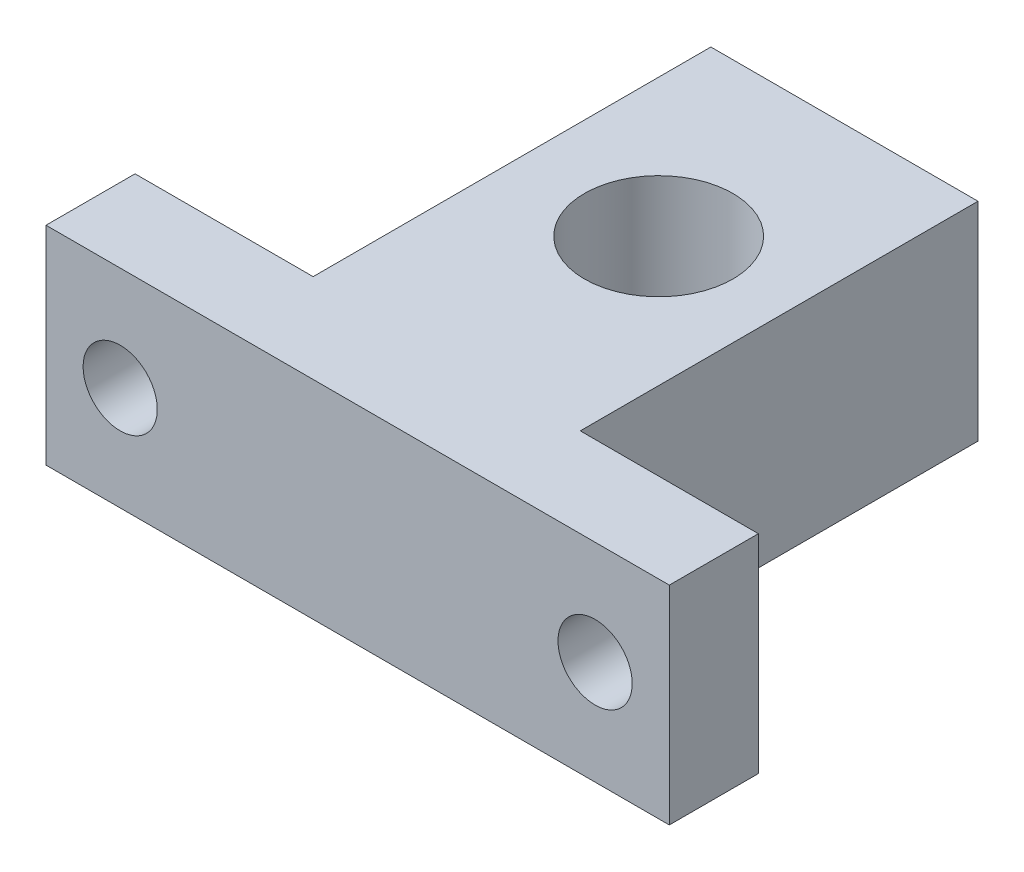
ISO-10303-21;
HEADER;
FILE_DESCRIPTION(('STEP AP214'),'2;1');
FILE_NAME('part.step','',(''),(''),'','','');
FILE_SCHEMA(('AUTOMOTIVE_DESIGN { 1 0 10303 214 1 1 1 1 }'));
ENDSEC;
DATA;
#1=APPLICATION_CONTEXT('core data for automotive mechanical design processes');
#2=APPLICATION_PROTOCOL_DEFINITION('international standard','automotive_design',2000,#1);
#3=PRODUCT_CONTEXT('',#1,'mechanical');
#4=PRODUCT('Part','Part','',(#3));
#5=PRODUCT_RELATED_PRODUCT_CATEGORY('part','',(#4));
#6=PRODUCT_DEFINITION_FORMATION('','',#4);
#7=PRODUCT_DEFINITION_CONTEXT('part definition',#1,'design');
#8=PRODUCT_DEFINITION('design','',#6,#7);
#9=PRODUCT_DEFINITION_SHAPE('','',#8);
#10=(LENGTH_UNIT() NAMED_UNIT(*) SI_UNIT(.MILLI.,.METRE.));
#11=(NAMED_UNIT(*) PLANE_ANGLE_UNIT() SI_UNIT($,.RADIAN.));
#12=(NAMED_UNIT(*) SI_UNIT($,.STERADIAN.) SOLID_ANGLE_UNIT());
#13=UNCERTAINTY_MEASURE_WITH_UNIT(LENGTH_MEASURE(1.E-05),#10,'distance_accuracy_value','');
#14=(GEOMETRIC_REPRESENTATION_CONTEXT(3) GLOBAL_UNCERTAINTY_ASSIGNED_CONTEXT((#13)) GLOBAL_UNIT_ASSIGNED_CONTEXT((#10,
#11,#12)) REPRESENTATION_CONTEXT('',''));
#15=CARTESIAN_POINT('',(0.,0.,0.));
#16=DIRECTION('',(0.,0.,1.));
#17=DIRECTION('',(1.,0.,0.));
#18=AXIS2_PLACEMENT_3D('',#15,#16,#17);
#19=CARTESIAN_POINT('',(0.,14.,0.));
#20=DIRECTION('',(0.,-1.,0.));
#21=DIRECTION('',(0.,0.,-1.));
#22=AXIS2_PLACEMENT_3D('',#19,#20,#21);
#23=PLANE('',#22);
#24=DIRECTION('',(0.,0.,1.));
#25=VECTOR('',#24,1.);
#26=CARTESIAN_POINT('',(-9.28421052631579,14.,-14.4473684210526));
#27=LINE('',#26,#25);
#28=CARTESIAN_POINT('',(-9.28421052631579,14.,-14.4473684210526));
#29=VERTEX_POINT('',#28);
#30=CARTESIAN_POINT('',(-9.28421052631579,14.,12.3526315789474));
#31=VERTEX_POINT('',#30);
#32=EDGE_CURVE('E166',#29,#31,#27,.T.);
#33=ORIENTED_EDGE('',*,*,#32,.T.);
#34=DIRECTION('',(-1.,0.,0.));
#35=VECTOR('',#34,1.);
#36=CARTESIAN_POINT('',(-9.28421052631579,14.,12.3526315789474));
#37=LINE('',#36,#35);
#38=CARTESIAN_POINT('',(-21.2842105263158,14.,12.3526315789474));
#39=VERTEX_POINT('',#38);
#40=EDGE_CURVE('E101',#31,#39,#37,.T.);
#41=ORIENTED_EDGE('',*,*,#40,.T.);
#42=DIRECTION('',(0.,0.,1.));
#43=VECTOR('',#42,1.);
#44=CARTESIAN_POINT('',(-21.2842105263158,14.,18.3526315789474));
#45=LINE('',#44,#43);
#46=CARTESIAN_POINT('',(-21.2842105263158,14.,18.3526315789474));
#47=VERTEX_POINT('',#46);
#48=EDGE_CURVE('E188',#39,#47,#45,.T.);
#49=ORIENTED_EDGE('',*,*,#48,.T.);
#50=DIRECTION('',(1.,0.,0.));
#51=VECTOR('',#50,1.);
#52=CARTESIAN_POINT('',(-0.28421052631579,14.,18.3526315789474));
#53=LINE('',#52,#51);
#54=CARTESIAN_POINT('',(20.7157894736842,14.,18.3526315789474));
#55=VERTEX_POINT('',#54);
#56=EDGE_CURVE('E201',#47,#55,#53,.T.);
#57=ORIENTED_EDGE('',*,*,#56,.T.);
#58=DIRECTION('',(0.,0.,-1.));
#59=VECTOR('',#58,1.);
#60=CARTESIAN_POINT('',(20.7157894736842,14.,18.3526315789474));
#61=LINE('',#60,#59);
#62=CARTESIAN_POINT('',(20.7157894736842,14.,12.3526315789474));
#63=VERTEX_POINT('',#62);
#64=EDGE_CURVE('E120',#55,#63,#61,.T.);
#65=ORIENTED_EDGE('',*,*,#64,.T.);
#66=DIRECTION('',(-1.,0.,0.));
#67=VECTOR('',#66,1.);
#68=CARTESIAN_POINT('',(8.71578947368421,14.,12.3526315789474));
#69=LINE('',#68,#67);
#70=CARTESIAN_POINT('',(8.71578947368421,14.,12.3526315789474));
#71=VERTEX_POINT('',#70);
#72=EDGE_CURVE('E114',#63,#71,#69,.T.);
#73=ORIENTED_EDGE('',*,*,#72,.T.);
#74=DIRECTION('',(0.,0.,-1.));
#75=VECTOR('',#74,1.);
#76=CARTESIAN_POINT('',(8.71578947368421,14.,-14.4473684210526));
#77=LINE('',#76,#75);
#78=CARTESIAN_POINT('',(8.71578947368421,14.,-14.4473684210526));
#79=VERTEX_POINT('',#78);
#80=EDGE_CURVE('E118',#71,#79,#77,.T.);
#81=ORIENTED_EDGE('',*,*,#80,.T.);
#82=DIRECTION('',(-1.,0.,0.));
#83=VECTOR('',#82,1.);
#84=CARTESIAN_POINT('',(-9.28421052631579,14.,-14.4473684210526));
#85=LINE('',#84,#83);
#86=EDGE_CURVE('E58',#79,#29,#85,.T.);
#87=ORIENTED_EDGE('',*,*,#86,.T.);
#88=EDGE_LOOP('',(#33,#41,#49,#57,#65,#73,#81,#87));
#89=FACE_BOUND('',#88,.T.);
#90=CARTESIAN_POINT('',(0.,14.,-1.64736842105261));
#91=DIRECTION('',(0.,1.,0.));
#92=DIRECTION('',(0.,0.,1.));
#93=AXIS2_PLACEMENT_3D('',#90,#91,#92);
#94=CIRCLE('',#93,5.);
#95=CARTESIAN_POINT('',(0.,14.,3.35263157894739));
#96=VERTEX_POINT('',#95);
#97=EDGE_CURVE('E147',#96,#96,#94,.T.);
#98=ORIENTED_EDGE('',*,*,#97,.F.);
#99=EDGE_LOOP('',(#98));
#100=FACE_BOUND('',#99,.T.);
#101=ADVANCED_FACE('F39',(#89,#100),#23,.F.);
#102=CARTESIAN_POINT('',(0.,0.,0.));
#103=DIRECTION('',(0.,-1.,0.));
#104=DIRECTION('',(0.,0.,-1.));
#105=AXIS2_PLACEMENT_3D('',#102,#103,#104);
#106=PLANE('',#105);
#107=DIRECTION('',(0.,0.,1.));
#108=VECTOR('',#107,1.);
#109=CARTESIAN_POINT('',(-9.28421052631579,0.,-14.4473684210526));
#110=LINE('',#109,#108);
#111=CARTESIAN_POINT('',(-9.28421052631579,0.,-14.4473684210526));
#112=VERTEX_POINT('',#111);
#113=CARTESIAN_POINT('',(-9.28421052631579,0.,12.3526315789474));
#114=VERTEX_POINT('',#113);
#115=EDGE_CURVE('E142',#112,#114,#110,.T.);
#116=ORIENTED_EDGE('',*,*,#115,.F.);
#117=DIRECTION('',(-1.,0.,0.));
#118=VECTOR('',#117,1.);
#119=CARTESIAN_POINT('',(-9.28421052631579,0.,-14.4473684210526));
#120=LINE('',#119,#118);
#121=CARTESIAN_POINT('',(8.71578947368421,0.,-14.4473684210526));
#122=VERTEX_POINT('',#121);
#123=EDGE_CURVE('E93',#122,#112,#120,.T.);
#124=ORIENTED_EDGE('',*,*,#123,.F.);
#125=DIRECTION('',(0.,0.,-1.));
#126=VECTOR('',#125,1.);
#127=CARTESIAN_POINT('',(8.71578947368421,0.,-14.4473684210526));
#128=LINE('',#127,#126);
#129=CARTESIAN_POINT('',(8.71578947368421,0.,12.3526315789474));
#130=VERTEX_POINT('',#129);
#131=EDGE_CURVE('E87',#130,#122,#128,.T.);
#132=ORIENTED_EDGE('',*,*,#131,.F.);
#133=DIRECTION('',(-1.,0.,0.));
#134=VECTOR('',#133,1.);
#135=CARTESIAN_POINT('',(8.71578947368421,0.,12.3526315789474));
#136=LINE('',#135,#134);
#137=CARTESIAN_POINT('',(20.7157894736842,0.,12.3526315789474));
#138=VERTEX_POINT('',#137);
#139=EDGE_CURVE('E129',#138,#130,#136,.T.);
#140=ORIENTED_EDGE('',*,*,#139,.F.);
#141=DIRECTION('',(0.,0.,-1.));
#142=VECTOR('',#141,1.);
#143=CARTESIAN_POINT('',(20.7157894736842,0.,18.3526315789474));
#144=LINE('',#143,#142);
#145=CARTESIAN_POINT('',(20.7157894736842,0.,18.3526315789474));
#146=VERTEX_POINT('',#145);
#147=EDGE_CURVE('E157',#146,#138,#144,.T.);
#148=ORIENTED_EDGE('',*,*,#147,.F.);
#149=DIRECTION('',(1.,0.,0.));
#150=VECTOR('',#149,1.);
#151=CARTESIAN_POINT('',(-0.28421052631579,0.,18.3526315789474));
#152=LINE('',#151,#150);
#153=CARTESIAN_POINT('',(-21.2842105263158,0.,18.3526315789474));
#154=VERTEX_POINT('',#153);
#155=EDGE_CURVE('E154',#154,#146,#152,.T.);
#156=ORIENTED_EDGE('',*,*,#155,.F.);
#157=DIRECTION('',(0.,0.,1.));
#158=VECTOR('',#157,1.);
#159=CARTESIAN_POINT('',(-21.2842105263158,0.,18.3526315789474));
#160=LINE('',#159,#158);
#161=CARTESIAN_POINT('',(-21.2842105263158,0.,12.3526315789474));
#162=VERTEX_POINT('',#161);
#163=EDGE_CURVE('E150',#162,#154,#160,.T.);
#164=ORIENTED_EDGE('',*,*,#163,.F.);
#165=DIRECTION('',(-1.,0.,0.));
#166=VECTOR('',#165,1.);
#167=CARTESIAN_POINT('',(-9.28421052631579,0.,12.3526315789474));
#168=LINE('',#167,#166);
#169=EDGE_CURVE('E146',#114,#162,#168,.T.);
#170=ORIENTED_EDGE('',*,*,#169,.F.);
#171=EDGE_LOOP('',(#116,#124,#132,#140,#148,#156,#164,#170));
#172=FACE_BOUND('',#171,.T.);
#173=CARTESIAN_POINT('',(0.,0.,-1.64736842105261));
#174=DIRECTION('',(0.,1.,0.));
#175=DIRECTION('',(0.,0.,1.));
#176=AXIS2_PLACEMENT_3D('',#173,#174,#175);
#177=CIRCLE('',#176,5.);
#178=CARTESIAN_POINT('',(0.,0.,3.35263157894739));
#179=VERTEX_POINT('',#178);
#180=EDGE_CURVE('E211',#179,#179,#177,.T.);
#181=ORIENTED_EDGE('',*,*,#180,.T.);
#182=EDGE_LOOP('',(#181));
#183=FACE_BOUND('',#182,.T.);
#184=ADVANCED_FACE('F191',(#172,#183),#106,.T.);
#185=CARTESIAN_POINT('',(-9.28421052631579,14.,-14.4473684210526));
#186=DIRECTION('',(1.,0.,0.));
#187=DIRECTION('',(0.,0.,-1.));
#188=AXIS2_PLACEMENT_3D('',#185,#186,#187);
#189=PLANE('',#188);
#190=ORIENTED_EDGE('',*,*,#115,.T.);
#191=DIRECTION('',(0.,-1.,0.));
#192=VECTOR('',#191,1.);
#193=CARTESIAN_POINT('',(-9.28421052631579,14.,12.3526315789474));
#194=LINE('',#193,#192);
#195=EDGE_CURVE('E11',#31,#114,#194,.T.);
#196=ORIENTED_EDGE('',*,*,#195,.F.);
#197=ORIENTED_EDGE('',*,*,#32,.F.);
#198=DIRECTION('',(0.,-1.,0.));
#199=VECTOR('',#198,1.);
#200=CARTESIAN_POINT('',(-9.28421052631579,14.,-14.4473684210526));
#201=LINE('',#200,#199);
#202=EDGE_CURVE('E138',#29,#112,#201,.T.);
#203=ORIENTED_EDGE('',*,*,#202,.T.);
#204=EDGE_LOOP('',(#190,#196,#197,#203));
#205=FACE_BOUND('',#204,.T.);
#206=ADVANCED_FACE('F41',(#205),#189,.F.);
#207=CARTESIAN_POINT('',(-9.28421052631579,14.,12.3526315789474));
#208=DIRECTION('',(0.,0.,1.));
#209=DIRECTION('',(1.,0.,0.));
#210=AXIS2_PLACEMENT_3D('',#207,#208,#209);
#211=PLANE('',#210);
#212=CARTESIAN_POINT('',(-16.2842105263158,7.,12.3526315789474));
#213=DIRECTION('',(0.,0.,-1.));
#214=DIRECTION('',(-1.,0.,0.));
#215=AXIS2_PLACEMENT_3D('',#212,#213,#214);
#216=CIRCLE('',#215,2.5);
#217=CARTESIAN_POINT('',(-18.7842105263158,7.,12.3526315789474));
#218=VERTEX_POINT('',#217);
#219=EDGE_CURVE('E223',#218,#218,#216,.T.);
#220=ORIENTED_EDGE('',*,*,#219,.F.);
#221=EDGE_LOOP('',(#220));
#222=FACE_BOUND('',#221,.T.);
#223=ORIENTED_EDGE('',*,*,#169,.T.);
#224=DIRECTION('',(0.,-1.,0.));
#225=VECTOR('',#224,1.);
#226=CARTESIAN_POINT('',(-21.2842105263158,14.,12.3526315789474));
#227=LINE('',#226,#225);
#228=EDGE_CURVE('E50',#39,#162,#227,.T.);
#229=ORIENTED_EDGE('',*,*,#228,.F.);
#230=ORIENTED_EDGE('',*,*,#40,.F.);
#231=ORIENTED_EDGE('',*,*,#195,.T.);
#232=EDGE_LOOP('',(#223,#229,#230,#231));
#233=FACE_BOUND('',#232,.T.);
#234=ADVANCED_FACE('F284',(#222,#233),#211,.F.);
#235=CARTESIAN_POINT('',(-21.2842105263158,14.,18.3526315789474));
#236=DIRECTION('',(1.,0.,0.));
#237=DIRECTION('',(0.,0.,-1.));
#238=AXIS2_PLACEMENT_3D('',#235,#236,#237);
#239=PLANE('',#238);
#240=ORIENTED_EDGE('',*,*,#163,.T.);
#241=DIRECTION('',(0.,-1.,0.));
#242=VECTOR('',#241,1.);
#243=CARTESIAN_POINT('',(-21.2842105263158,14.,18.3526315789474));
#244=LINE('',#243,#242);
#245=EDGE_CURVE('E177',#47,#154,#244,.T.);
#246=ORIENTED_EDGE('',*,*,#245,.F.);
#247=ORIENTED_EDGE('',*,*,#48,.F.);
#248=ORIENTED_EDGE('',*,*,#228,.T.);
#249=EDGE_LOOP('',(#240,#246,#247,#248));
#250=FACE_BOUND('',#249,.T.);
#251=ADVANCED_FACE('F186',(#250),#239,.F.);
#252=CARTESIAN_POINT('',(-0.28421052631579,14.,18.3526315789474));
#253=DIRECTION('',(0.,0.,-1.));
#254=DIRECTION('',(-1.,0.,0.));
#255=AXIS2_PLACEMENT_3D('',#252,#253,#254);
#256=PLANE('',#255);
#257=CARTESIAN_POINT('',(15.7157894736842,7.,18.3526315789474));
#258=DIRECTION('',(0.,0.,-1.));
#259=DIRECTION('',(-1.,0.,0.));
#260=AXIS2_PLACEMENT_3D('',#257,#258,#259);
#261=CIRCLE('',#260,2.5);
#262=CARTESIAN_POINT('',(13.2157894736842,7.,18.3526315789474));
#263=VERTEX_POINT('',#262);
#264=EDGE_CURVE('E218',#263,#263,#261,.T.);
#265=ORIENTED_EDGE('',*,*,#264,.T.);
#266=EDGE_LOOP('',(#265));
#267=FACE_BOUND('',#266,.T.);
#268=CARTESIAN_POINT('',(-16.2842105263158,7.,18.3526315789474));
#269=DIRECTION('',(0.,0.,-1.));
#270=DIRECTION('',(-1.,0.,0.));
#271=AXIS2_PLACEMENT_3D('',#268,#269,#270);
#272=CIRCLE('',#271,2.5);
#273=CARTESIAN_POINT('',(-18.7842105263158,7.,18.3526315789474));
#274=VERTEX_POINT('',#273);
#275=EDGE_CURVE('E43',#274,#274,#272,.T.);
#276=ORIENTED_EDGE('',*,*,#275,.T.);
#277=EDGE_LOOP('',(#276));
#278=FACE_BOUND('',#277,.T.);
#279=ORIENTED_EDGE('',*,*,#155,.T.);
#280=DIRECTION('',(0.,-1.,0.));
#281=VECTOR('',#280,1.);
#282=CARTESIAN_POINT('',(20.7157894736842,14.,18.3526315789474));
#283=LINE('',#282,#281);
#284=EDGE_CURVE('E173',#55,#146,#283,.T.);
#285=ORIENTED_EDGE('',*,*,#284,.F.);
#286=ORIENTED_EDGE('',*,*,#56,.F.);
#287=ORIENTED_EDGE('',*,*,#245,.T.);
#288=EDGE_LOOP('',(#279,#285,#286,#287));
#289=FACE_BOUND('',#288,.T.);
#290=ADVANCED_FACE('F196',(#267,#278,#289),#256,.F.);
#291=CARTESIAN_POINT('',(20.7157894736842,14.,18.3526315789474));
#292=DIRECTION('',(-1.,0.,0.));
#293=DIRECTION('',(0.,0.,1.));
#294=AXIS2_PLACEMENT_3D('',#291,#292,#293);
#295=PLANE('',#294);
#296=ORIENTED_EDGE('',*,*,#147,.T.);
#297=DIRECTION('',(0.,-1.,0.));
#298=VECTOR('',#297,1.);
#299=CARTESIAN_POINT('',(20.7157894736842,14.,12.3526315789474));
#300=LINE('',#299,#298);
#301=EDGE_CURVE('E131',#63,#138,#300,.T.);
#302=ORIENTED_EDGE('',*,*,#301,.F.);
#303=ORIENTED_EDGE('',*,*,#64,.F.);
#304=ORIENTED_EDGE('',*,*,#284,.T.);
#305=EDGE_LOOP('',(#296,#302,#303,#304));
#306=FACE_BOUND('',#305,.T.);
#307=ADVANCED_FACE('F199',(#306),#295,.F.);
#308=CARTESIAN_POINT('',(8.71578947368421,14.,12.3526315789474));
#309=DIRECTION('',(0.,0.,1.));
#310=DIRECTION('',(1.,0.,0.));
#311=AXIS2_PLACEMENT_3D('',#308,#309,#310);
#312=PLANE('',#311);
#313=CARTESIAN_POINT('',(15.7157894736842,7.,12.3526315789474));
#314=DIRECTION('',(0.,0.,-1.));
#315=DIRECTION('',(-1.,0.,0.));
#316=AXIS2_PLACEMENT_3D('',#313,#314,#315);
#317=CIRCLE('',#316,2.5);
#318=CARTESIAN_POINT('',(13.2157894736842,7.,12.3526315789474));
#319=VERTEX_POINT('',#318);
#320=EDGE_CURVE('E222',#319,#319,#317,.T.);
#321=ORIENTED_EDGE('',*,*,#320,.F.);
#322=EDGE_LOOP('',(#321));
#323=FACE_BOUND('',#322,.T.);
#324=ORIENTED_EDGE('',*,*,#139,.T.);
#325=DIRECTION('',(0.,-1.,0.));
#326=VECTOR('',#325,1.);
#327=CARTESIAN_POINT('',(8.71578947368421,14.,12.3526315789474));
#328=LINE('',#327,#326);
#329=EDGE_CURVE('E126',#71,#130,#328,.T.);
#330=ORIENTED_EDGE('',*,*,#329,.F.);
#331=ORIENTED_EDGE('',*,*,#72,.F.);
#332=ORIENTED_EDGE('',*,*,#301,.T.);
#333=EDGE_LOOP('',(#324,#330,#331,#332));
#334=FACE_BOUND('',#333,.T.);
#335=ADVANCED_FACE('F127',(#323,#334),#312,.F.);
#336=CARTESIAN_POINT('',(8.71578947368421,14.,-14.4473684210526));
#337=DIRECTION('',(-1.,0.,0.));
#338=DIRECTION('',(0.,0.,1.));
#339=AXIS2_PLACEMENT_3D('',#336,#337,#338);
#340=PLANE('',#339);
#341=ORIENTED_EDGE('',*,*,#131,.T.);
#342=DIRECTION('',(0.,-1.,0.));
#343=VECTOR('',#342,1.);
#344=CARTESIAN_POINT('',(8.71578947368421,14.,-14.4473684210526));
#345=LINE('',#344,#343);
#346=EDGE_CURVE('E132',#79,#122,#345,.T.);
#347=ORIENTED_EDGE('',*,*,#346,.F.);
#348=ORIENTED_EDGE('',*,*,#80,.F.);
#349=ORIENTED_EDGE('',*,*,#329,.T.);
#350=EDGE_LOOP('',(#341,#347,#348,#349));
#351=FACE_BOUND('',#350,.T.);
#352=ADVANCED_FACE('F134',(#351),#340,.F.);
#353=CARTESIAN_POINT('',(-9.28421052631579,14.,-14.4473684210526));
#354=DIRECTION('',(0.,0.,1.));
#355=DIRECTION('',(1.,0.,0.));
#356=AXIS2_PLACEMENT_3D('',#353,#354,#355);
#357=PLANE('',#356);
#358=ORIENTED_EDGE('',*,*,#123,.T.);
#359=ORIENTED_EDGE('',*,*,#202,.F.);
#360=ORIENTED_EDGE('',*,*,#86,.F.);
#361=ORIENTED_EDGE('',*,*,#346,.T.);
#362=EDGE_LOOP('',(#358,#359,#360,#361));
#363=FACE_BOUND('',#362,.T.);
#364=ADVANCED_FACE('F240',(#363),#357,.F.);
#365=CARTESIAN_POINT('',(0.,14.,-1.64736842105261));
#366=DIRECTION('',(0.,-1.,0.));
#367=DIRECTION('',(0.,0.,-1.));
#368=AXIS2_PLACEMENT_3D('',#365,#366,#367);
#369=CYLINDRICAL_SURFACE('',#368,5.);
#370=ORIENTED_EDGE('',*,*,#97,.T.);
#371=EDGE_LOOP('',(#370));
#372=FACE_BOUND('',#371,.T.);
#373=ORIENTED_EDGE('',*,*,#180,.F.);
#374=EDGE_LOOP('',(#373));
#375=FACE_BOUND('',#374,.T.);
#376=ADVANCED_FACE('F250',(#372,#375),#369,.F.);
#377=CARTESIAN_POINT('',(15.7157894736842,7.,26.3526315789474));
#378=DIRECTION('',(0.,0.,-1.));
#379=DIRECTION('',(-1.,0.,0.));
#380=AXIS2_PLACEMENT_3D('',#377,#378,#379);
#381=CYLINDRICAL_SURFACE('',#380,2.5);
#382=ORIENTED_EDGE('',*,*,#320,.T.);
#383=EDGE_LOOP('',(#382));
#384=FACE_BOUND('',#383,.T.);
#385=ORIENTED_EDGE('',*,*,#264,.F.);
#386=EDGE_LOOP('',(#385));
#387=FACE_BOUND('',#386,.T.);
#388=ADVANCED_FACE('F231',(#384,#387),#381,.F.);
#389=CARTESIAN_POINT('',(-16.2842105263158,7.,26.3526315789474));
#390=DIRECTION('',(0.,0.,-1.));
#391=DIRECTION('',(-1.,0.,0.));
#392=AXIS2_PLACEMENT_3D('',#389,#390,#391);
#393=CYLINDRICAL_SURFACE('',#392,2.5);
#394=ORIENTED_EDGE('',*,*,#219,.T.);
#395=EDGE_LOOP('',(#394));
#396=FACE_BOUND('',#395,.T.);
#397=ORIENTED_EDGE('',*,*,#275,.F.);
#398=EDGE_LOOP('',(#397));
#399=FACE_BOUND('',#398,.T.);
#400=ADVANCED_FACE('F261',(#396,#399),#393,.F.);
#401=CLOSED_SHELL('',(#101,#184,#206,#234,#251,#290,#307,#335,#352,#364,#376,#388,#400));
#402=MANIFOLD_SOLID_BREP('B2',#401);
#403=ADVANCED_BREP_SHAPE_REPRESENTATION('',(#18,#402),#14);
#404=SHAPE_DEFINITION_REPRESENTATION(#9,#403);
ENDSEC;
END-ISO-10303-21;
